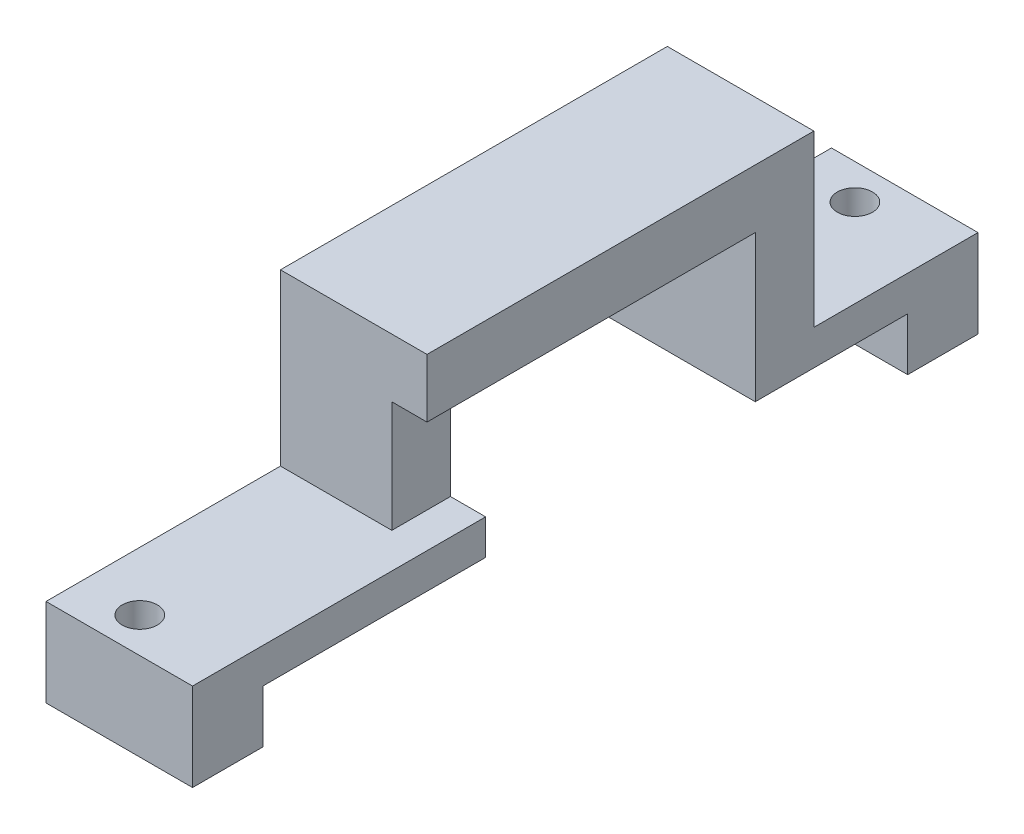
ISO-10303-21;
HEADER;
FILE_DESCRIPTION(('STEP AP214'),'2;1');
FILE_NAME('part.step','',(''),(''),'','','');
FILE_SCHEMA(('AUTOMOTIVE_DESIGN { 1 0 10303 214 1 1 1 1 }'));
ENDSEC;
DATA;
#1=APPLICATION_CONTEXT('core data for automotive mechanical design processes');
#2=APPLICATION_PROTOCOL_DEFINITION('international standard','automotive_design',2000,#1);
#3=PRODUCT_CONTEXT('',#1,'mechanical');
#4=PRODUCT('Part','Part','',(#3));
#5=PRODUCT_RELATED_PRODUCT_CATEGORY('part','',(#4));
#6=PRODUCT_DEFINITION_FORMATION('','',#4);
#7=PRODUCT_DEFINITION_CONTEXT('part definition',#1,'design');
#8=PRODUCT_DEFINITION('design','',#6,#7);
#9=PRODUCT_DEFINITION_SHAPE('','',#8);
#10=(LENGTH_UNIT() NAMED_UNIT(*) SI_UNIT(.MILLI.,.METRE.));
#11=(NAMED_UNIT(*) PLANE_ANGLE_UNIT() SI_UNIT($,.RADIAN.));
#12=(NAMED_UNIT(*) SI_UNIT($,.STERADIAN.) SOLID_ANGLE_UNIT());
#13=UNCERTAINTY_MEASURE_WITH_UNIT(LENGTH_MEASURE(1.E-05),#10,'distance_accuracy_value','');
#14=(GEOMETRIC_REPRESENTATION_CONTEXT(3) GLOBAL_UNCERTAINTY_ASSIGNED_CONTEXT((#13)) GLOBAL_UNIT_ASSIGNED_CONTEXT((#10,
#11,#12)) REPRESENTATION_CONTEXT('',''));
#15=CARTESIAN_POINT('',(0.,0.,0.));
#16=DIRECTION('',(0.,0.,1.));
#17=DIRECTION('',(1.,0.,0.));
#18=AXIS2_PLACEMENT_3D('',#15,#16,#17);
#19=CARTESIAN_POINT('',(12.5,-4.5,0.));
#20=DIRECTION('',(0.,1.,0.));
#21=DIRECTION('',(0.,0.,1.));
#22=AXIS2_PLACEMENT_3D('',#19,#20,#21);
#23=PLANE('',#22);
#24=CARTESIAN_POINT('',(-7.5,-4.5,-3.));
#25=DIRECTION('',(0.,-1.,0.));
#26=DIRECTION('',(0.,0.,1.));
#27=AXIS2_PLACEMENT_3D('',#24,#25,#26);
#28=CIRCLE('',#27,1.5);
#29=CARTESIAN_POINT('',(-7.5,-4.5,-1.5));
#30=VERTEX_POINT('',#29);
#31=EDGE_CURVE('E300',#30,#30,#28,.T.);
#32=ORIENTED_EDGE('',*,*,#31,.F.);
#33=EDGE_LOOP('',(#32));
#34=FACE_BOUND('',#33,.T.);
#35=DIRECTION('',(0.,0.,-1.));
#36=VECTOR('',#35,1.);
#37=CARTESIAN_POINT('',(0.,-4.5,0.));
#38=LINE('',#37,#36);
#39=CARTESIAN_POINT('',(0.,-4.5,0.));
#40=VERTEX_POINT('',#39);
#41=CARTESIAN_POINT('',(0.,-4.5,-6.));
#42=VERTEX_POINT('',#41);
#43=EDGE_CURVE('E162',#40,#42,#38,.T.);
#44=ORIENTED_EDGE('',*,*,#43,.F.);
#45=DIRECTION('',(-1.,0.,0.));
#46=VECTOR('',#45,1.);
#47=CARTESIAN_POINT('',(12.5,-4.5,0.));
#48=LINE('',#47,#46);
#49=CARTESIAN_POINT('',(-12.5,-4.5,0.));
#50=VERTEX_POINT('',#49);
#51=EDGE_CURVE('E47',#40,#50,#48,.T.);
#52=ORIENTED_EDGE('',*,*,#51,.T.);
#53=DIRECTION('',(0.,0.,-1.));
#54=VECTOR('',#53,1.);
#55=CARTESIAN_POINT('',(-12.5,-4.5,0.));
#56=LINE('',#55,#54);
#57=CARTESIAN_POINT('',(-12.5,-4.5,-6.));
#58=VERTEX_POINT('',#57);
#59=EDGE_CURVE('E291',#50,#58,#56,.T.);
#60=ORIENTED_EDGE('',*,*,#59,.T.);
#61=DIRECTION('',(-1.,0.,0.));
#62=VECTOR('',#61,1.);
#63=CARTESIAN_POINT('',(12.5,-4.5,-6.));
#64=LINE('',#63,#62);
#65=EDGE_CURVE('E171',#42,#58,#64,.T.);
#66=ORIENTED_EDGE('',*,*,#65,.F.);
#67=EDGE_LOOP('',(#44,#52,#60,#66));
#68=FACE_BOUND('',#67,.T.);
#69=ADVANCED_FACE('F39',(#34,#68),#23,.F.);
#70=CARTESIAN_POINT('',(12.5,-4.5,-6.));
#71=DIRECTION('',(0.,0.,1.));
#72=DIRECTION('',(1.,0.,0.));
#73=AXIS2_PLACEMENT_3D('',#70,#71,#72);
#74=PLANE('',#73);
#75=DIRECTION('',(0.,1.,0.));
#76=VECTOR('',#75,1.);
#77=CARTESIAN_POINT('',(0.,-4.5,-6.));
#78=LINE('',#77,#76);
#79=CARTESIAN_POINT('',(0.,0.,-6.));
#80=VERTEX_POINT('',#79);
#81=EDGE_CURVE('E174',#42,#80,#78,.T.);
#82=ORIENTED_EDGE('',*,*,#81,.F.);
#83=ORIENTED_EDGE('',*,*,#65,.T.);
#84=DIRECTION('',(0.,1.,0.));
#85=VECTOR('',#84,1.);
#86=CARTESIAN_POINT('',(-12.5,-4.5,-6.));
#87=LINE('',#86,#85);
#88=CARTESIAN_POINT('',(-12.5,0.,-6.));
#89=VERTEX_POINT('',#88);
#90=EDGE_CURVE('E287',#58,#89,#87,.T.);
#91=ORIENTED_EDGE('',*,*,#90,.T.);
#92=DIRECTION('',(-1.,0.,0.));
#93=VECTOR('',#92,1.);
#94=CARTESIAN_POINT('',(12.5,0.,-6.));
#95=LINE('',#94,#93);
#96=EDGE_CURVE('E182',#80,#89,#95,.T.);
#97=ORIENTED_EDGE('',*,*,#96,.F.);
#98=EDGE_LOOP('',(#82,#83,#91,#97));
#99=FACE_BOUND('',#98,.T.);
#100=ADVANCED_FACE('F463',(#99),#74,.F.);
#101=CARTESIAN_POINT('',(12.5,0.,-6.));
#102=DIRECTION('',(0.,1.,0.));
#103=DIRECTION('',(0.,0.,1.));
#104=AXIS2_PLACEMENT_3D('',#101,#102,#103);
#105=PLANE('',#104);
#106=DIRECTION('',(0.,0.,-1.));
#107=VECTOR('',#106,1.);
#108=CARTESIAN_POINT('',(0.,0.,-6.));
#109=LINE('',#108,#107);
#110=CARTESIAN_POINT('',(0.,0.,-25.));
#111=VERTEX_POINT('',#110);
#112=EDGE_CURVE('E357',#80,#111,#109,.T.);
#113=ORIENTED_EDGE('',*,*,#112,.F.);
#114=ORIENTED_EDGE('',*,*,#96,.T.);
#115=DIRECTION('',(0.,0.,-1.));
#116=VECTOR('',#115,1.);
#117=CARTESIAN_POINT('',(-12.5,0.,-6.));
#118=LINE('',#117,#116);
#119=CARTESIAN_POINT('',(-12.5,0.,-25.));
#120=VERTEX_POINT('',#119);
#121=EDGE_CURVE('E283',#89,#120,#118,.T.);
#122=ORIENTED_EDGE('',*,*,#121,.T.);
#123=DIRECTION('',(-1.,0.,0.));
#124=VECTOR('',#123,1.);
#125=CARTESIAN_POINT('',(12.5,0.,-25.));
#126=LINE('',#125,#124);
#127=EDGE_CURVE('E187',#111,#120,#126,.T.);
#128=ORIENTED_EDGE('',*,*,#127,.F.);
#129=EDGE_LOOP('',(#113,#114,#122,#128));
#130=FACE_BOUND('',#129,.T.);
#131=ADVANCED_FACE('F460',(#130),#105,.F.);
#132=CARTESIAN_POINT('',(12.5,0.,-25.));
#133=DIRECTION('',(0.,0.,1.));
#134=DIRECTION('',(0.,-1.,0.));
#135=AXIS2_PLACEMENT_3D('',#132,#133,#134);
#136=PLANE('',#135);
#137=DIRECTION('',(0.,1.,0.));
#138=VECTOR('',#137,1.);
#139=CARTESIAN_POINT('',(0.,0.,-25.));
#140=LINE('',#139,#138);
#141=CARTESIAN_POINT('',(0.,3.,-25.));
#142=VERTEX_POINT('',#141);
#143=EDGE_CURVE('E360',#111,#142,#140,.T.);
#144=ORIENTED_EDGE('',*,*,#143,.F.);
#145=ORIENTED_EDGE('',*,*,#127,.T.);
#146=DIRECTION('',(0.,1.,0.));
#147=VECTOR('',#146,1.);
#148=CARTESIAN_POINT('',(-12.5,0.,-25.));
#149=LINE('',#148,#147);
#150=CARTESIAN_POINT('',(-12.5,12.5,-25.));
#151=VERTEX_POINT('',#150);
#152=EDGE_CURVE('E279',#120,#151,#149,.T.);
#153=ORIENTED_EDGE('',*,*,#152,.T.);
#154=DIRECTION('',(1.,0.,0.));
#155=VECTOR('',#154,1.);
#156=CARTESIAN_POINT('',(-12.5,12.5,-25.));
#157=LINE('',#156,#155);
#158=CARTESIAN_POINT('',(-3.,12.5,-25.));
#159=VERTEX_POINT('',#158);
#160=EDGE_CURVE('E224',#151,#159,#157,.T.);
#161=ORIENTED_EDGE('',*,*,#160,.T.);
#162=DIRECTION('',(0.,1.,0.));
#163=VECTOR('',#162,1.);
#164=CARTESIAN_POINT('',(-3.,3.,-25.));
#165=LINE('',#164,#163);
#166=CARTESIAN_POINT('',(-3.,3.,-25.));
#167=VERTEX_POINT('',#166);
#168=EDGE_CURVE('E316',#167,#159,#165,.T.);
#169=ORIENTED_EDGE('',*,*,#168,.F.);
#170=DIRECTION('',(1.,0.,0.));
#171=VECTOR('',#170,1.);
#172=CARTESIAN_POINT('',(0.,3.,-25.));
#173=LINE('',#172,#171);
#174=EDGE_CURVE('E220',#167,#142,#173,.T.);
#175=ORIENTED_EDGE('',*,*,#174,.T.);
#176=EDGE_LOOP('',(#144,#145,#153,#161,#169,#175));
#177=FACE_BOUND('',#176,.T.);
#178=ADVANCED_FACE('F455',(#177),#136,.F.);
#179=CARTESIAN_POINT('',(12.5,12.5,-25.));
#180=DIRECTION('',(0.,1.,0.));
#181=DIRECTION('',(0.,0.,1.));
#182=AXIS2_PLACEMENT_3D('',#179,#180,#181);
#183=PLANE('',#182);
#184=DIRECTION('',(0.,0.,-1.));
#185=VECTOR('',#184,1.);
#186=CARTESIAN_POINT('',(0.,12.5,-25.));
#187=LINE('',#186,#185);
#188=CARTESIAN_POINT('',(0.,12.5,-20.));
#189=VERTEX_POINT('',#188);
#190=CARTESIAN_POINT('',(0.,12.5,-48.));
#191=VERTEX_POINT('',#190);
#192=EDGE_CURVE('E324',#189,#191,#187,.T.);
#193=ORIENTED_EDGE('',*,*,#192,.F.);
#194=DIRECTION('',(-1.,0.,0.));
#195=VECTOR('',#194,1.);
#196=CARTESIAN_POINT('',(0.,12.5,-20.));
#197=LINE('',#196,#195);
#198=CARTESIAN_POINT('',(-3.,12.5,-20.));
#199=VERTEX_POINT('',#198);
#200=EDGE_CURVE('E221',#189,#199,#197,.T.);
#201=ORIENTED_EDGE('',*,*,#200,.T.);
#202=DIRECTION('',(0.,0.,1.));
#203=VECTOR('',#202,1.);
#204=CARTESIAN_POINT('',(-3.,12.5,-25.));
#205=LINE('',#204,#203);
#206=EDGE_CURVE('E309',#159,#199,#205,.T.);
#207=ORIENTED_EDGE('',*,*,#206,.F.);
#208=ORIENTED_EDGE('',*,*,#160,.F.);
#209=DIRECTION('',(0.,0.,-1.));
#210=VECTOR('',#209,1.);
#211=CARTESIAN_POINT('',(-12.5,12.5,-25.));
#212=LINE('',#211,#210);
#213=CARTESIAN_POINT('',(-12.5,12.5,-48.));
#214=VERTEX_POINT('',#213);
#215=EDGE_CURVE('E275',#151,#214,#212,.T.);
#216=ORIENTED_EDGE('',*,*,#215,.T.);
#217=DIRECTION('',(-1.,0.,0.));
#218=VECTOR('',#217,1.);
#219=CARTESIAN_POINT('',(12.5,12.5,-48.));
#220=LINE('',#219,#218);
#221=EDGE_CURVE('E190',#191,#214,#220,.T.);
#222=ORIENTED_EDGE('',*,*,#221,.F.);
#223=EDGE_LOOP('',(#193,#201,#207,#208,#216,#222));
#224=FACE_BOUND('',#223,.T.);
#225=ADVANCED_FACE('F451',(#224),#183,.F.);
#226=CARTESIAN_POINT('',(12.5,12.5,-48.));
#227=DIRECTION('',(0.,0.,-1.));
#228=DIRECTION('',(-1.,0.,0.));
#229=AXIS2_PLACEMENT_3D('',#226,#227,#228);
#230=PLANE('',#229);
#231=DIRECTION('',(0.,-1.,0.));
#232=VECTOR('',#231,1.);
#233=CARTESIAN_POINT('',(0.,12.5,-48.));
#234=LINE('',#233,#232);
#235=CARTESIAN_POINT('',(0.,0.,-48.));
#236=VERTEX_POINT('',#235);
#237=EDGE_CURVE('E330',#191,#236,#234,.T.);
#238=ORIENTED_EDGE('',*,*,#237,.F.);
#239=ORIENTED_EDGE('',*,*,#221,.T.);
#240=DIRECTION('',(0.,-1.,0.));
#241=VECTOR('',#240,1.);
#242=CARTESIAN_POINT('',(-12.5,12.5,-48.));
#243=LINE('',#242,#241);
#244=CARTESIAN_POINT('',(-12.5,0.,-48.));
#245=VERTEX_POINT('',#244);
#246=EDGE_CURVE('E271',#214,#245,#243,.T.);
#247=ORIENTED_EDGE('',*,*,#246,.T.);
#248=DIRECTION('',(-1.,0.,0.));
#249=VECTOR('',#248,1.);
#250=CARTESIAN_POINT('',(12.5,0.,-48.));
#251=LINE('',#250,#249);
#252=EDGE_CURVE('E193',#236,#245,#251,.T.);
#253=ORIENTED_EDGE('',*,*,#252,.F.);
#254=EDGE_LOOP('',(#238,#239,#247,#253));
#255=FACE_BOUND('',#254,.T.);
#256=ADVANCED_FACE('F445',(#255),#230,.F.);
#257=CARTESIAN_POINT('',(12.5,0.,-48.));
#258=DIRECTION('',(0.,1.,0.));
#259=DIRECTION('',(0.,0.,1.));
#260=AXIS2_PLACEMENT_3D('',#257,#258,#259);
#261=PLANE('',#260);
#262=DIRECTION('',(0.,0.,-1.));
#263=VECTOR('',#262,1.);
#264=CARTESIAN_POINT('',(0.,0.,-48.));
#265=LINE('',#264,#263);
#266=CARTESIAN_POINT('',(0.,0.,-61.));
#267=VERTEX_POINT('',#266);
#268=EDGE_CURVE('E333',#236,#267,#265,.T.);
#269=ORIENTED_EDGE('',*,*,#268,.F.);
#270=ORIENTED_EDGE('',*,*,#252,.T.);
#271=DIRECTION('',(0.,0.,-1.));
#272=VECTOR('',#271,1.);
#273=CARTESIAN_POINT('',(-12.5,0.,-48.));
#274=LINE('',#273,#272);
#275=CARTESIAN_POINT('',(-12.5,0.,-61.));
#276=VERTEX_POINT('',#275);
#277=EDGE_CURVE('E267',#245,#276,#274,.T.);
#278=ORIENTED_EDGE('',*,*,#277,.T.);
#279=DIRECTION('',(-1.,0.,0.));
#280=VECTOR('',#279,1.);
#281=CARTESIAN_POINT('',(12.5,0.,-61.));
#282=LINE('',#281,#280);
#283=EDGE_CURVE('E196',#267,#276,#282,.T.);
#284=ORIENTED_EDGE('',*,*,#283,.F.);
#285=EDGE_LOOP('',(#269,#270,#278,#284));
#286=FACE_BOUND('',#285,.T.);
#287=ADVANCED_FACE('F441',(#286),#261,.F.);
#288=CARTESIAN_POINT('',(12.5,-4.5,-61.));
#289=DIRECTION('',(0.,0.,-1.));
#290=DIRECTION('',(-1.,0.,0.));
#291=AXIS2_PLACEMENT_3D('',#288,#289,#290);
#292=PLANE('',#291);
#293=DIRECTION('',(0.,-1.,0.));
#294=VECTOR('',#293,1.);
#295=CARTESIAN_POINT('',(0.,-4.5,-61.));
#296=LINE('',#295,#294);
#297=CARTESIAN_POINT('',(0.,-4.5,-61.));
#298=VERTEX_POINT('',#297);
#299=EDGE_CURVE('E336',#267,#298,#296,.T.);
#300=ORIENTED_EDGE('',*,*,#299,.F.);
#301=ORIENTED_EDGE('',*,*,#283,.T.);
#302=DIRECTION('',(0.,-1.,0.));
#303=VECTOR('',#302,1.);
#304=CARTESIAN_POINT('',(-12.5,-4.5,-61.));
#305=LINE('',#304,#303);
#306=CARTESIAN_POINT('',(-12.5,-4.5,-61.));
#307=VERTEX_POINT('',#306);
#308=EDGE_CURVE('E263',#276,#307,#305,.T.);
#309=ORIENTED_EDGE('',*,*,#308,.T.);
#310=DIRECTION('',(-1.,0.,0.));
#311=VECTOR('',#310,1.);
#312=CARTESIAN_POINT('',(12.5,-4.5,-61.));
#313=LINE('',#312,#311);
#314=EDGE_CURVE('E199',#298,#307,#313,.T.);
#315=ORIENTED_EDGE('',*,*,#314,.F.);
#316=EDGE_LOOP('',(#300,#301,#309,#315));
#317=FACE_BOUND('',#316,.T.);
#318=ADVANCED_FACE('F435',(#317),#292,.F.);
#319=CARTESIAN_POINT('',(12.5,-4.5,-61.));
#320=DIRECTION('',(0.,1.,0.));
#321=DIRECTION('',(0.,0.,1.));
#322=AXIS2_PLACEMENT_3D('',#319,#320,#321);
#323=PLANE('',#322);
#324=CARTESIAN_POINT('',(-7.5,-4.5,-64.));
#325=DIRECTION('',(0.,-1.,0.));
#326=DIRECTION('',(0.,0.,1.));
#327=AXIS2_PLACEMENT_3D('',#324,#325,#326);
#328=CIRCLE('',#327,1.5);
#329=CARTESIAN_POINT('',(-7.5,-4.5,-62.5));
#330=VERTEX_POINT('',#329);
#331=EDGE_CURVE('E296',#330,#330,#328,.T.);
#332=ORIENTED_EDGE('',*,*,#331,.F.);
#333=EDGE_LOOP('',(#332));
#334=FACE_BOUND('',#333,.T.);
#335=DIRECTION('',(0.,0.,-1.));
#336=VECTOR('',#335,1.);
#337=CARTESIAN_POINT('',(0.,-4.5,-61.));
#338=LINE('',#337,#336);
#339=CARTESIAN_POINT('',(0.,-4.5,-67.));
#340=VERTEX_POINT('',#339);
#341=EDGE_CURVE('E339',#298,#340,#338,.T.);
#342=ORIENTED_EDGE('',*,*,#341,.F.);
#343=ORIENTED_EDGE('',*,*,#314,.T.);
#344=DIRECTION('',(0.,0.,-1.));
#345=VECTOR('',#344,1.);
#346=CARTESIAN_POINT('',(-12.5,-4.5,-61.));
#347=LINE('',#346,#345);
#348=CARTESIAN_POINT('',(-12.5,-4.5,-67.));
#349=VERTEX_POINT('',#348);
#350=EDGE_CURVE('E259',#307,#349,#347,.T.);
#351=ORIENTED_EDGE('',*,*,#350,.T.);
#352=DIRECTION('',(-1.,0.,0.));
#353=VECTOR('',#352,1.);
#354=CARTESIAN_POINT('',(12.5,-4.5,-67.));
#355=LINE('',#354,#353);
#356=EDGE_CURVE('E202',#340,#349,#355,.T.);
#357=ORIENTED_EDGE('',*,*,#356,.F.);
#358=EDGE_LOOP('',(#342,#343,#351,#357));
#359=FACE_BOUND('',#358,.T.);
#360=ADVANCED_FACE('F431',(#334,#359),#323,.F.);
#361=CARTESIAN_POINT('',(12.5,3.,-67.));
#362=DIRECTION('',(0.,0.,1.));
#363=DIRECTION('',(1.,0.,0.));
#364=AXIS2_PLACEMENT_3D('',#361,#362,#363);
#365=PLANE('',#364);
#366=DIRECTION('',(0.,1.,0.));
#367=VECTOR('',#366,1.);
#368=CARTESIAN_POINT('',(0.,3.,-67.));
#369=LINE('',#368,#367);
#370=CARTESIAN_POINT('',(0.,3.,-67.));
#371=VERTEX_POINT('',#370);
#372=EDGE_CURVE('E342',#340,#371,#369,.T.);
#373=ORIENTED_EDGE('',*,*,#372,.F.);
#374=ORIENTED_EDGE('',*,*,#356,.T.);
#375=DIRECTION('',(0.,1.,0.));
#376=VECTOR('',#375,1.);
#377=CARTESIAN_POINT('',(-12.5,-4.5,-67.));
#378=LINE('',#377,#376);
#379=CARTESIAN_POINT('',(-12.5,3.,-67.));
#380=VERTEX_POINT('',#379);
#381=EDGE_CURVE('E255',#349,#380,#378,.T.);
#382=ORIENTED_EDGE('',*,*,#381,.T.);
#383=DIRECTION('',(-1.,0.,0.));
#384=VECTOR('',#383,1.);
#385=CARTESIAN_POINT('',(12.5,3.,-67.));
#386=LINE('',#385,#384);
#387=EDGE_CURVE('E205',#371,#380,#386,.T.);
#388=ORIENTED_EDGE('',*,*,#387,.F.);
#389=EDGE_LOOP('',(#373,#374,#382,#388));
#390=FACE_BOUND('',#389,.T.);
#391=ADVANCED_FACE('F425',(#390),#365,.F.);
#392=CARTESIAN_POINT('',(12.5,3.,-53.));
#393=DIRECTION('',(0.,-1.,0.));
#394=DIRECTION('',(0.,0.,-1.));
#395=AXIS2_PLACEMENT_3D('',#392,#393,#394);
#396=PLANE('',#395);
#397=CARTESIAN_POINT('',(-7.5,3.,-64.));
#398=DIRECTION('',(0.,-1.,0.));
#399=DIRECTION('',(0.,0.,-1.));
#400=AXIS2_PLACEMENT_3D('',#397,#398,#399);
#401=CIRCLE('',#400,1.5);
#402=CARTESIAN_POINT('',(-7.5,3.,-65.5));
#403=VERTEX_POINT('',#402);
#404=EDGE_CURVE('E305',#403,#403,#401,.T.);
#405=ORIENTED_EDGE('',*,*,#404,.T.);
#406=EDGE_LOOP('',(#405));
#407=FACE_BOUND('',#406,.T.);
#408=DIRECTION('',(0.,0.,1.));
#409=VECTOR('',#408,1.);
#410=CARTESIAN_POINT('',(0.,3.,-53.));
#411=LINE('',#410,#409);
#412=CARTESIAN_POINT('',(0.,3.,-53.));
#413=VERTEX_POINT('',#412);
#414=EDGE_CURVE('E345',#371,#413,#411,.T.);
#415=ORIENTED_EDGE('',*,*,#414,.F.);
#416=ORIENTED_EDGE('',*,*,#387,.T.);
#417=DIRECTION('',(0.,0.,1.));
#418=VECTOR('',#417,1.);
#419=CARTESIAN_POINT('',(-12.5,3.,-53.));
#420=LINE('',#419,#418);
#421=CARTESIAN_POINT('',(-12.5,3.,-53.));
#422=VERTEX_POINT('',#421);
#423=EDGE_CURVE('E251',#380,#422,#420,.T.);
#424=ORIENTED_EDGE('',*,*,#423,.T.);
#425=DIRECTION('',(-1.,0.,0.));
#426=VECTOR('',#425,1.);
#427=CARTESIAN_POINT('',(12.5,3.,-53.));
#428=LINE('',#427,#426);
#429=EDGE_CURVE('E208',#413,#422,#428,.T.);
#430=ORIENTED_EDGE('',*,*,#429,.F.);
#431=EDGE_LOOP('',(#415,#416,#424,#430));
#432=FACE_BOUND('',#431,.T.);
#433=ADVANCED_FACE('F421',(#407,#432),#396,.F.);
#434=CARTESIAN_POINT('',(12.5,17.5,-53.));
#435=DIRECTION('',(0.,0.,1.));
#436=DIRECTION('',(0.,-1.,0.));
#437=AXIS2_PLACEMENT_3D('',#434,#435,#436);
#438=PLANE('',#437);
#439=DIRECTION('',(0.,1.,0.));
#440=VECTOR('',#439,1.);
#441=CARTESIAN_POINT('',(0.,17.5,-53.));
#442=LINE('',#441,#440);
#443=CARTESIAN_POINT('',(0.,17.5,-53.));
#444=VERTEX_POINT('',#443);
#445=EDGE_CURVE('E348',#413,#444,#442,.T.);
#446=ORIENTED_EDGE('',*,*,#445,.F.);
#447=ORIENTED_EDGE('',*,*,#429,.T.);
#448=DIRECTION('',(0.,1.,0.));
#449=VECTOR('',#448,1.);
#450=CARTESIAN_POINT('',(-12.5,17.5,-53.));
#451=LINE('',#450,#449);
#452=CARTESIAN_POINT('',(-12.5,17.5,-53.));
#453=VERTEX_POINT('',#452);
#454=EDGE_CURVE('E247',#422,#453,#451,.T.);
#455=ORIENTED_EDGE('',*,*,#454,.T.);
#456=DIRECTION('',(-1.,0.,0.));
#457=VECTOR('',#456,1.);
#458=CARTESIAN_POINT('',(12.5,17.5,-53.));
#459=LINE('',#458,#457);
#460=EDGE_CURVE('E211',#444,#453,#459,.T.);
#461=ORIENTED_EDGE('',*,*,#460,.F.);
#462=EDGE_LOOP('',(#446,#447,#455,#461));
#463=FACE_BOUND('',#462,.T.);
#464=ADVANCED_FACE('F415',(#463),#438,.F.);
#465=CARTESIAN_POINT('',(12.5,17.5,-20.));
#466=DIRECTION('',(0.,-1.,0.));
#467=DIRECTION('',(0.,0.,-1.));
#468=AXIS2_PLACEMENT_3D('',#465,#466,#467);
#469=PLANE('',#468);
#470=DIRECTION('',(0.,0.,1.));
#471=VECTOR('',#470,1.);
#472=CARTESIAN_POINT('',(0.,17.5,-20.));
#473=LINE('',#472,#471);
#474=CARTESIAN_POINT('',(0.,17.5,-20.));
#475=VERTEX_POINT('',#474);
#476=EDGE_CURVE('E54',#444,#475,#473,.T.);
#477=ORIENTED_EDGE('',*,*,#476,.F.);
#478=ORIENTED_EDGE('',*,*,#460,.T.);
#479=DIRECTION('',(0.,0.,1.));
#480=VECTOR('',#479,1.);
#481=CARTESIAN_POINT('',(-12.5,17.5,-20.));
#482=LINE('',#481,#480);
#483=CARTESIAN_POINT('',(-12.5,17.5,-20.));
#484=VERTEX_POINT('',#483);
#485=EDGE_CURVE('E243',#453,#484,#482,.T.);
#486=ORIENTED_EDGE('',*,*,#485,.T.);
#487=DIRECTION('',(-1.,0.,0.));
#488=VECTOR('',#487,1.);
#489=CARTESIAN_POINT('',(12.5,17.5,-20.));
#490=LINE('',#489,#488);
#491=EDGE_CURVE('E214',#475,#484,#490,.T.);
#492=ORIENTED_EDGE('',*,*,#491,.F.);
#493=EDGE_LOOP('',(#477,#478,#486,#492));
#494=FACE_BOUND('',#493,.T.);
#495=ADVANCED_FACE('F411',(#494),#469,.F.);
#496=CARTESIAN_POINT('',(12.5,3.,-20.));
#497=DIRECTION('',(0.,0.,-1.));
#498=DIRECTION('',(-1.,0.,0.));
#499=AXIS2_PLACEMENT_3D('',#496,#497,#498);
#500=PLANE('',#499);
#501=DIRECTION('',(0.,-1.,0.));
#502=VECTOR('',#501,1.);
#503=CARTESIAN_POINT('',(0.,3.,-20.));
#504=LINE('',#503,#502);
#505=EDGE_CURVE('E173',#475,#189,#504,.T.);
#506=ORIENTED_EDGE('',*,*,#505,.F.);
#507=ORIENTED_EDGE('',*,*,#491,.T.);
#508=DIRECTION('',(0.,-1.,0.));
#509=VECTOR('',#508,1.);
#510=CARTESIAN_POINT('',(-12.5,3.,-20.));
#511=LINE('',#510,#509);
#512=CARTESIAN_POINT('',(-12.5,3.,-20.));
#513=VERTEX_POINT('',#512);
#514=EDGE_CURVE('E239',#484,#513,#511,.T.);
#515=ORIENTED_EDGE('',*,*,#514,.T.);
#516=DIRECTION('',(1.,0.,0.));
#517=VECTOR('',#516,1.);
#518=CARTESIAN_POINT('',(-12.5,3.,-20.));
#519=LINE('',#518,#517);
#520=CARTESIAN_POINT('',(-3.,3.,-20.));
#521=VERTEX_POINT('',#520);
#522=EDGE_CURVE('E231',#513,#521,#519,.T.);
#523=ORIENTED_EDGE('',*,*,#522,.T.);
#524=DIRECTION('',(0.,1.,0.));
#525=VECTOR('',#524,1.);
#526=CARTESIAN_POINT('',(-3.,3.,-20.));
#527=LINE('',#526,#525);
#528=EDGE_CURVE('E320',#521,#199,#527,.T.);
#529=ORIENTED_EDGE('',*,*,#528,.T.);
#530=ORIENTED_EDGE('',*,*,#200,.F.);
#531=EDGE_LOOP('',(#506,#507,#515,#523,#529,#530));
#532=FACE_BOUND('',#531,.T.);
#533=ADVANCED_FACE('F406',(#532),#500,.F.);
#534=CARTESIAN_POINT('',(12.5,3.,0.));
#535=DIRECTION('',(0.,-1.,0.));
#536=DIRECTION('',(0.,0.,-1.));
#537=AXIS2_PLACEMENT_3D('',#534,#535,#536);
#538=PLANE('',#537);
#539=CARTESIAN_POINT('',(-7.5,3.,-3.));
#540=DIRECTION('',(0.,-1.,0.));
#541=DIRECTION('',(0.,0.,1.));
#542=AXIS2_PLACEMENT_3D('',#539,#540,#541);
#543=CIRCLE('',#542,1.5);
#544=CARTESIAN_POINT('',(-7.5,3.,-1.5));
#545=VERTEX_POINT('',#544);
#546=EDGE_CURVE('E304',#545,#545,#543,.T.);
#547=ORIENTED_EDGE('',*,*,#546,.T.);
#548=EDGE_LOOP('',(#547));
#549=FACE_BOUND('',#548,.T.);
#550=DIRECTION('',(0.,0.,1.));
#551=VECTOR('',#550,1.);
#552=CARTESIAN_POINT('',(0.,3.,0.));
#553=LINE('',#552,#551);
#554=CARTESIAN_POINT('',(0.,3.,0.));
#555=VERTEX_POINT('',#554);
#556=EDGE_CURVE('E61',#142,#555,#553,.T.);
#557=ORIENTED_EDGE('',*,*,#556,.F.);
#558=ORIENTED_EDGE('',*,*,#174,.F.);
#559=DIRECTION('',(0.,0.,1.));
#560=VECTOR('',#559,1.);
#561=CARTESIAN_POINT('',(-3.,3.,-25.));
#562=LINE('',#561,#560);
#563=EDGE_CURVE('E313',#167,#521,#562,.T.);
#564=ORIENTED_EDGE('',*,*,#563,.T.);
#565=ORIENTED_EDGE('',*,*,#522,.F.);
#566=DIRECTION('',(0.,0.,1.));
#567=VECTOR('',#566,1.);
#568=CARTESIAN_POINT('',(-12.5,3.,0.));
#569=LINE('',#568,#567);
#570=CARTESIAN_POINT('',(-12.5,3.,0.));
#571=VERTEX_POINT('',#570);
#572=EDGE_CURVE('E235',#513,#571,#569,.T.);
#573=ORIENTED_EDGE('',*,*,#572,.T.);
#574=DIRECTION('',(-1.,0.,0.));
#575=VECTOR('',#574,1.);
#576=CARTESIAN_POINT('',(12.5,3.,0.));
#577=LINE('',#576,#575);
#578=EDGE_CURVE('E217',#555,#571,#577,.T.);
#579=ORIENTED_EDGE('',*,*,#578,.F.);
#580=EDGE_LOOP('',(#557,#558,#564,#565,#573,#579));
#581=FACE_BOUND('',#580,.T.);
#582=ADVANCED_FACE('F402',(#549,#581),#538,.F.);
#583=CARTESIAN_POINT('',(12.5,3.,0.));
#584=DIRECTION('',(0.,0.,-1.));
#585=DIRECTION('',(-1.,0.,0.));
#586=AXIS2_PLACEMENT_3D('',#583,#584,#585);
#587=PLANE('',#586);
#588=DIRECTION('',(0.,-1.,0.));
#589=VECTOR('',#588,1.);
#590=CARTESIAN_POINT('',(0.,3.,0.));
#591=LINE('',#590,#589);
#592=EDGE_CURVE('E11',#555,#40,#591,.T.);
#593=ORIENTED_EDGE('',*,*,#592,.F.);
#594=ORIENTED_EDGE('',*,*,#578,.T.);
#595=DIRECTION('',(0.,-1.,0.));
#596=VECTOR('',#595,1.);
#597=CARTESIAN_POINT('',(-12.5,0.,0.));
#598=LINE('',#597,#596);
#599=EDGE_CURVE('E178',#571,#50,#598,.T.);
#600=ORIENTED_EDGE('',*,*,#599,.T.);
#601=ORIENTED_EDGE('',*,*,#51,.F.);
#602=EDGE_LOOP('',(#593,#594,#600,#601));
#603=FACE_BOUND('',#602,.T.);
#604=ADVANCED_FACE('F176',(#603),#587,.F.);
#605=CARTESIAN_POINT('',(-12.5,0.,0.));
#606=DIRECTION('',(-1.,0.,0.));
#607=DIRECTION('',(0.,0.,-1.));
#608=AXIS2_PLACEMENT_3D('',#605,#606,#607);
#609=PLANE('',#608);
#610=CARTESIAN_POINT('',(-12.5,6.25,-50.35));
#611=DIRECTION('',(-1.,0.,0.));
#612=DIRECTION('',(0.,0.,1.));
#613=AXIS2_PLACEMENT_3D('',#610,#611,#612);
#614=CIRCLE('',#613,0.999999999999998);
#615=CARTESIAN_POINT('',(-12.5,6.25,-49.35));
#616=VERTEX_POINT('',#615);
#617=EDGE_CURVE('E374',#616,#616,#614,.T.);
#618=ORIENTED_EDGE('',*,*,#617,.F.);
#619=EDGE_LOOP('',(#618));
#620=FACE_BOUND('',#619,.T.);
#621=CARTESIAN_POINT('',(-12.5,6.25,-22.65));
#622=DIRECTION('',(-1.,0.,0.));
#623=DIRECTION('',(0.,0.,-1.));
#624=AXIS2_PLACEMENT_3D('',#621,#622,#623);
#625=CIRCLE('',#624,0.999999999999998);
#626=CARTESIAN_POINT('',(-12.5,6.25,-23.65));
#627=VERTEX_POINT('',#626);
#628=EDGE_CURVE('E366',#627,#627,#625,.T.);
#629=ORIENTED_EDGE('',*,*,#628,.F.);
#630=EDGE_LOOP('',(#629));
#631=FACE_BOUND('',#630,.T.);
#632=ORIENTED_EDGE('',*,*,#599,.F.);
#633=ORIENTED_EDGE('',*,*,#572,.F.);
#634=ORIENTED_EDGE('',*,*,#514,.F.);
#635=ORIENTED_EDGE('',*,*,#485,.F.);
#636=ORIENTED_EDGE('',*,*,#454,.F.);
#637=ORIENTED_EDGE('',*,*,#423,.F.);
#638=ORIENTED_EDGE('',*,*,#381,.F.);
#639=ORIENTED_EDGE('',*,*,#350,.F.);
#640=ORIENTED_EDGE('',*,*,#308,.F.);
#641=ORIENTED_EDGE('',*,*,#277,.F.);
#642=ORIENTED_EDGE('',*,*,#246,.F.);
#643=ORIENTED_EDGE('',*,*,#215,.F.);
#644=ORIENTED_EDGE('',*,*,#152,.F.);
#645=ORIENTED_EDGE('',*,*,#121,.F.);
#646=ORIENTED_EDGE('',*,*,#90,.F.);
#647=ORIENTED_EDGE('',*,*,#59,.F.);
#648=EDGE_LOOP('',(#632,#633,#634,#635,#636,#637,#638,#639,#640,#641,#642,#643,#644,#645,#646,#647));
#649=FACE_BOUND('',#648,.T.);
#650=ADVANCED_FACE('F391',(#620,#631,#649),#609,.T.);
#651=CARTESIAN_POINT('',(-7.5,-9.5,-3.));
#652=DIRECTION('',(0.,1.,0.));
#653=DIRECTION('',(0.,0.,1.));
#654=AXIS2_PLACEMENT_3D('',#651,#652,#653);
#655=CYLINDRICAL_SURFACE('',#654,1.5);
#656=ORIENTED_EDGE('',*,*,#546,.F.);
#657=EDGE_LOOP('',(#656));
#658=FACE_BOUND('',#657,.T.);
#659=ORIENTED_EDGE('',*,*,#31,.T.);
#660=EDGE_LOOP('',(#659));
#661=FACE_BOUND('',#660,.T.);
#662=ADVANCED_FACE('F394',(#658,#661),#655,.F.);
#663=CARTESIAN_POINT('',(-7.5,-9.5,-64.));
#664=DIRECTION('',(0.,1.,0.));
#665=DIRECTION('',(0.,0.,1.));
#666=AXIS2_PLACEMENT_3D('',#663,#664,#665);
#667=CYLINDRICAL_SURFACE('',#666,1.5);
#668=ORIENTED_EDGE('',*,*,#404,.F.);
#669=EDGE_LOOP('',(#668));
#670=FACE_BOUND('',#669,.T.);
#671=ORIENTED_EDGE('',*,*,#331,.T.);
#672=EDGE_LOOP('',(#671));
#673=FACE_BOUND('',#672,.T.);
#674=ADVANCED_FACE('F486',(#670,#673),#667,.F.);
#675=CARTESIAN_POINT('',(-3.,3.,-25.));
#676=DIRECTION('',(-1.,0.,0.));
#677=DIRECTION('',(0.,0.,-1.));
#678=AXIS2_PLACEMENT_3D('',#675,#676,#677);
#679=PLANE('',#678);
#680=ORIENTED_EDGE('',*,*,#528,.F.);
#681=ORIENTED_EDGE('',*,*,#563,.F.);
#682=ORIENTED_EDGE('',*,*,#168,.T.);
#683=ORIENTED_EDGE('',*,*,#206,.T.);
#684=EDGE_LOOP('',(#680,#681,#682,#683));
#685=FACE_BOUND('',#684,.T.);
#686=ADVANCED_FACE('F465',(#685),#679,.F.);
#687=CARTESIAN_POINT('',(0.,0.,0.));
#688=DIRECTION('',(1.,0.,0.));
#689=DIRECTION('',(0.,0.,-1.));
#690=AXIS2_PLACEMENT_3D('',#687,#688,#689);
#691=PLANE('',#690);
#692=ORIENTED_EDGE('',*,*,#43,.T.);
#693=ORIENTED_EDGE('',*,*,#81,.T.);
#694=ORIENTED_EDGE('',*,*,#112,.T.);
#695=ORIENTED_EDGE('',*,*,#143,.T.);
#696=ORIENTED_EDGE('',*,*,#556,.T.);
#697=ORIENTED_EDGE('',*,*,#592,.T.);
#698=EDGE_LOOP('',(#692,#693,#694,#695,#696,#697));
#699=FACE_BOUND('',#698,.T.);
#700=ADVANCED_FACE('F161',(#699),#691,.T.);
#701=ORIENTED_EDGE('',*,*,#192,.T.);
#702=ORIENTED_EDGE('',*,*,#237,.T.);
#703=ORIENTED_EDGE('',*,*,#268,.T.);
#704=ORIENTED_EDGE('',*,*,#299,.T.);
#705=ORIENTED_EDGE('',*,*,#341,.T.);
#706=ORIENTED_EDGE('',*,*,#372,.T.);
#707=ORIENTED_EDGE('',*,*,#414,.T.);
#708=ORIENTED_EDGE('',*,*,#445,.T.);
#709=ORIENTED_EDGE('',*,*,#476,.T.);
#710=ORIENTED_EDGE('',*,*,#505,.T.);
#711=EDGE_LOOP('',(#701,#702,#703,#704,#705,#706,#707,#708,#709,#710));
#712=FACE_BOUND('',#711,.T.);
#713=ADVANCED_FACE('F467',(#712),#691,.T.);
#714=CARTESIAN_POINT('',(-9.5,6.25,-22.65));
#715=DIRECTION('',(-1.,0.,0.));
#716=DIRECTION('',(0.,0.,1.));
#717=AXIS2_PLACEMENT_3D('',#714,#715,#716);
#718=CYLINDRICAL_SURFACE('',#717,0.999999999999998);
#719=CARTESIAN_POINT('',(-9.5,6.25,-22.65));
#720=DIRECTION('',(-1.,0.,0.));
#721=DIRECTION('',(0.,0.,-1.));
#722=AXIS2_PLACEMENT_3D('',#719,#720,#721);
#723=CIRCLE('',#722,0.999999999999998);
#724=CARTESIAN_POINT('',(-9.5,6.25,-23.65));
#725=VERTEX_POINT('',#724);
#726=EDGE_CURVE('E370',#725,#725,#723,.T.);
#727=ORIENTED_EDGE('',*,*,#726,.F.);
#728=EDGE_LOOP('',(#727));
#729=FACE_BOUND('',#728,.T.);
#730=ORIENTED_EDGE('',*,*,#628,.T.);
#731=EDGE_LOOP('',(#730));
#732=FACE_BOUND('',#731,.T.);
#733=ADVANCED_FACE('F469',(#729,#732),#718,.F.);
#734=CARTESIAN_POINT('',(-9.5,6.25,-22.65));
#735=DIRECTION('',(1.,0.,0.));
#736=DIRECTION('',(0.,0.,-1.));
#737=AXIS2_PLACEMENT_3D('',#734,#735,#736);
#738=PLANE('',#737);
#739=ORIENTED_EDGE('',*,*,#726,.T.);
#740=EDGE_LOOP('',(#739));
#741=FACE_BOUND('',#740,.T.);
#742=ADVANCED_FACE('F387',(#741),#738,.F.);
#743=CARTESIAN_POINT('',(-9.5,6.25,-50.35));
#744=DIRECTION('',(-1.,0.,0.));
#745=DIRECTION('',(0.,0.,1.));
#746=AXIS2_PLACEMENT_3D('',#743,#744,#745);
#747=CYLINDRICAL_SURFACE('',#746,0.999999999999998);
#748=CARTESIAN_POINT('',(-9.5,6.25,-50.35));
#749=DIRECTION('',(-1.,0.,0.));
#750=DIRECTION('',(0.,0.,1.));
#751=AXIS2_PLACEMENT_3D('',#748,#749,#750);
#752=CIRCLE('',#751,0.999999999999998);
#753=CARTESIAN_POINT('',(-9.5,6.25,-49.35));
#754=VERTEX_POINT('',#753);
#755=EDGE_CURVE('E365',#754,#754,#752,.T.);
#756=ORIENTED_EDGE('',*,*,#755,.F.);
#757=EDGE_LOOP('',(#756));
#758=FACE_BOUND('',#757,.T.);
#759=ORIENTED_EDGE('',*,*,#617,.T.);
#760=EDGE_LOOP('',(#759));
#761=FACE_BOUND('',#760,.T.);
#762=ADVANCED_FACE('F384',(#758,#761),#747,.F.);
#763=CARTESIAN_POINT('',(-9.5,6.25,-50.35));
#764=DIRECTION('',(-1.,0.,0.));
#765=DIRECTION('',(0.,0.,1.));
#766=AXIS2_PLACEMENT_3D('',#763,#764,#765);
#767=PLANE('',#766);
#768=ORIENTED_EDGE('',*,*,#755,.T.);
#769=EDGE_LOOP('',(#768));
#770=FACE_BOUND('',#769,.T.);
#771=ADVANCED_FACE('F382',(#770),#767,.T.);
#772=CLOSED_SHELL('',(#69,#100,#131,#178,#225,#256,#287,#318,#360,#391,#433,#464,#495,#533,#582,
#604,#650,#662,#674,#686,#700,#713,#733,#742,#762,#771));
#773=MANIFOLD_SOLID_BREP('B2',#772);
#774=ADVANCED_BREP_SHAPE_REPRESENTATION('',(#18,#773),#14);
#775=SHAPE_DEFINITION_REPRESENTATION(#9,#774);
ENDSEC;
END-ISO-10303-21;
